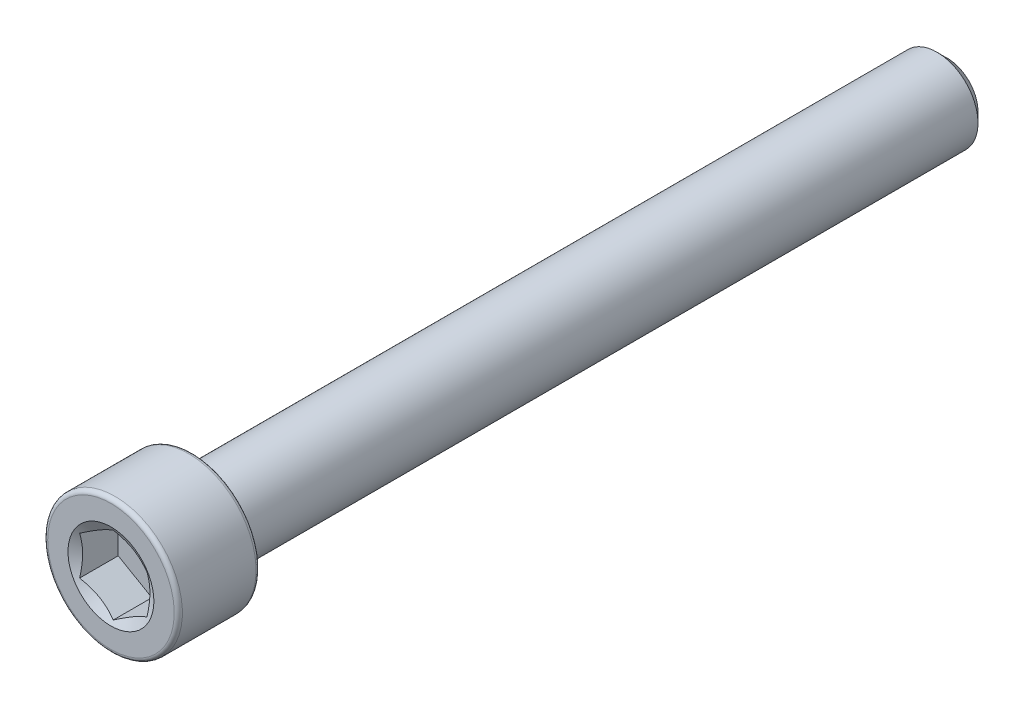
ISO-10303-21;
HEADER;
FILE_DESCRIPTION(('STEP AP214'),'2;1');
FILE_NAME('part.step','',(''),(''),'','','');
FILE_SCHEMA(('AUTOMOTIVE_DESIGN { 1 0 10303 214 1 1 1 1 }'));
ENDSEC;
DATA;
#1=APPLICATION_CONTEXT('core data for automotive mechanical design processes');
#2=APPLICATION_PROTOCOL_DEFINITION('international standard','automotive_design',2000,#1);
#3=PRODUCT_CONTEXT('',#1,'mechanical');
#4=PRODUCT('Part','Part','',(#3));
#5=PRODUCT_RELATED_PRODUCT_CATEGORY('part','',(#4));
#6=PRODUCT_DEFINITION_FORMATION('','',#4);
#7=PRODUCT_DEFINITION_CONTEXT('part definition',#1,'design');
#8=PRODUCT_DEFINITION('design','',#6,#7);
#9=PRODUCT_DEFINITION_SHAPE('','',#8);
#10=(LENGTH_UNIT() NAMED_UNIT(*) SI_UNIT(.MILLI.,.METRE.));
#11=(NAMED_UNIT(*) PLANE_ANGLE_UNIT() SI_UNIT($,.RADIAN.));
#12=(NAMED_UNIT(*) SI_UNIT($,.STERADIAN.) SOLID_ANGLE_UNIT());
#13=UNCERTAINTY_MEASURE_WITH_UNIT(LENGTH_MEASURE(1.E-05),#10,'distance_accuracy_value','');
#14=(GEOMETRIC_REPRESENTATION_CONTEXT(3) GLOBAL_UNCERTAINTY_ASSIGNED_CONTEXT((#13)) GLOBAL_UNIT_ASSIGNED_CONTEXT((#10,
#11,#12)) REPRESENTATION_CONTEXT('',''));
#15=CARTESIAN_POINT('',(0.,0.,0.));
#16=DIRECTION('',(0.,0.,1.));
#17=DIRECTION('',(1.,0.,0.));
#18=AXIS2_PLACEMENT_3D('',#15,#16,#17);
#19=CARTESIAN_POINT('',(0.,0.,-24.638));
#20=DIRECTION('',(0.,0.,-1.));
#21=DIRECTION('',(-1.,0.,0.));
#22=AXIS2_PLACEMENT_3D('',#19,#20,#21);
#23=PLANE('',#22);
#24=CARTESIAN_POINT('',(0.,0.,-24.638));
#25=DIRECTION('',(0.,0.,-1.));
#26=DIRECTION('',(-1.,0.,0.));
#27=AXIS2_PLACEMENT_3D('',#24,#25,#26);
#28=CIRCLE('',#27,1.81768750000002);
#29=CARTESIAN_POINT('',(-1.81768750000002,0.,-24.638));
#30=VERTEX_POINT('',#29);
#31=EDGE_CURVE('E50',#30,#30,#28,.T.);
#32=ORIENTED_EDGE('',*,*,#31,.T.);
#33=EDGE_LOOP('',(#32));
#34=FACE_BOUND('',#33,.T.);
#35=ADVANCED_FACE('F37',(#34),#23,.T.);
#36=CARTESIAN_POINT('',(0.,0.,-24.638));
#37=DIRECTION('',(0.,0.,1.));
#38=DIRECTION('',(1.,0.,0.));
#39=AXIS2_PLACEMENT_3D('',#36,#37,#38);
#40=CONICAL_SURFACE('',#39,1.81768750000002,0.78539816339745);
#41=CARTESIAN_POINT('',(0.,0.,-24.0426875));
#42=DIRECTION('',(0.,0.,-1.));
#43=DIRECTION('',(-1.,0.,0.));
#44=AXIS2_PLACEMENT_3D('',#41,#42,#43);
#45=CIRCLE('',#44,2.41300000000002);
#46=CARTESIAN_POINT('',(-2.41300000000002,0.,-24.0426875));
#47=VERTEX_POINT('',#46);
#48=EDGE_CURVE('E135',#47,#47,#45,.T.);
#49=ORIENTED_EDGE('',*,*,#48,.T.);
#50=EDGE_LOOP('',(#49));
#51=FACE_BOUND('',#50,.T.);
#52=ORIENTED_EDGE('',*,*,#31,.F.);
#53=EDGE_LOOP('',(#52));
#54=FACE_BOUND('',#53,.T.);
#55=ADVANCED_FACE('F141',(#51,#54),#40,.T.);
#56=CARTESIAN_POINT('',(0.,0.,-24.638));
#57=DIRECTION('',(0.,0.,-1.));
#58=DIRECTION('',(-1.,0.,0.));
#59=AXIS2_PLACEMENT_3D('',#56,#57,#58);
#60=CYLINDRICAL_SURFACE('',#59,2.41300000000002);
#61=CARTESIAN_POINT('',(0.,0.,19.812));
#62=DIRECTION('',(0.,0.,-1.));
#63=DIRECTION('',(-1.,0.,0.));
#64=AXIS2_PLACEMENT_3D('',#61,#62,#63);
#65=CIRCLE('',#64,2.41300000000002);
#66=CARTESIAN_POINT('',(-2.41300000000002,0.,19.812));
#67=VERTEX_POINT('',#66);
#68=EDGE_CURVE('E132',#67,#67,#65,.T.);
#69=ORIENTED_EDGE('',*,*,#68,.T.);
#70=EDGE_LOOP('',(#69));
#71=FACE_BOUND('',#70,.T.);
#72=ORIENTED_EDGE('',*,*,#48,.F.);
#73=EDGE_LOOP('',(#72));
#74=FACE_BOUND('',#73,.T.);
#75=ADVANCED_FACE('F143',(#71,#74),#60,.T.);
#76=CARTESIAN_POINT('',(0.,2.413,19.812));
#77=DIRECTION('',(0.,0.,-1.));
#78=DIRECTION('',(-1.,0.,0.));
#79=AXIS2_PLACEMENT_3D('',#76,#77,#78);
#80=PLANE('',#79);
#81=CARTESIAN_POINT('',(0.,0.,19.812));
#82=DIRECTION('',(0.,0.,-1.));
#83=DIRECTION('',(-1.,0.,0.));
#84=AXIS2_PLACEMENT_3D('',#81,#82,#83);
#85=CIRCLE('',#84,3.72745);
#86=CARTESIAN_POINT('',(-3.72745,0.,19.812));
#87=VERTEX_POINT('',#86);
#88=EDGE_CURVE('E129',#87,#87,#85,.T.);
#89=ORIENTED_EDGE('',*,*,#88,.T.);
#90=EDGE_LOOP('',(#89));
#91=FACE_BOUND('',#90,.T.);
#92=ORIENTED_EDGE('',*,*,#68,.F.);
#93=EDGE_LOOP('',(#92));
#94=FACE_BOUND('',#93,.T.);
#95=ADVANCED_FACE('F149',(#91,#94),#80,.T.);
#96=CARTESIAN_POINT('',(0.,0.,20.0533));
#97=DIRECTION('',(0.,0.,-1.));
#98=DIRECTION('',(-1.,0.,0.));
#99=AXIS2_PLACEMENT_3D('',#96,#97,#98);
#100=TOROIDAL_SURFACE('',#99,3.72745,0.2413);
#101=CARTESIAN_POINT('',(0.,0.,20.0533));
#102=DIRECTION('',(0.,0.,-1.));
#103=DIRECTION('',(-1.,0.,0.));
#104=AXIS2_PLACEMENT_3D('',#101,#102,#103);
#105=CIRCLE('',#104,3.96875);
#106=CARTESIAN_POINT('',(-3.96875,0.,20.0533));
#107=VERTEX_POINT('',#106);
#108=EDGE_CURVE('E126',#107,#107,#105,.T.);
#109=ORIENTED_EDGE('',*,*,#108,.T.);
#110=EDGE_LOOP('',(#109));
#111=FACE_BOUND('',#110,.T.);
#112=ORIENTED_EDGE('',*,*,#88,.F.);
#113=EDGE_LOOP('',(#112));
#114=FACE_BOUND('',#113,.T.);
#115=ADVANCED_FACE('F155',(#111,#114),#100,.T.);
#116=CARTESIAN_POINT('',(0.,0.,-24.638));
#117=DIRECTION('',(0.,0.,-1.));
#118=DIRECTION('',(-1.,0.,0.));
#119=AXIS2_PLACEMENT_3D('',#116,#117,#118);
#120=CYLINDRICAL_SURFACE('',#119,3.96875);
#121=CARTESIAN_POINT('',(0.,0.,24.3967));
#122=DIRECTION('',(0.,0.,-1.));
#123=DIRECTION('',(-1.,0.,0.));
#124=AXIS2_PLACEMENT_3D('',#121,#122,#123);
#125=CIRCLE('',#124,3.96875);
#126=CARTESIAN_POINT('',(-3.96875,0.,24.3967));
#127=VERTEX_POINT('',#126);
#128=EDGE_CURVE('E123',#127,#127,#125,.T.);
#129=ORIENTED_EDGE('',*,*,#128,.T.);
#130=EDGE_LOOP('',(#129));
#131=FACE_BOUND('',#130,.T.);
#132=ORIENTED_EDGE('',*,*,#108,.F.);
#133=EDGE_LOOP('',(#132));
#134=FACE_BOUND('',#133,.T.);
#135=ADVANCED_FACE('F159',(#131,#134),#120,.T.);
#136=CARTESIAN_POINT('',(0.,0.,24.3967));
#137=DIRECTION('',(0.,0.,-1.));
#138=DIRECTION('',(-1.,0.,0.));
#139=AXIS2_PLACEMENT_3D('',#136,#137,#138);
#140=TOROIDAL_SURFACE('',#139,3.72745,0.241299999999999);
#141=CARTESIAN_POINT('',(0.,0.,24.638));
#142=DIRECTION('',(0.,0.,-1.));
#143=DIRECTION('',(-1.,0.,0.));
#144=AXIS2_PLACEMENT_3D('',#141,#142,#143);
#145=CIRCLE('',#144,3.72745);
#146=CARTESIAN_POINT('',(-3.72745,0.,24.638));
#147=VERTEX_POINT('',#146);
#148=EDGE_CURVE('E120',#147,#147,#145,.T.);
#149=ORIENTED_EDGE('',*,*,#148,.T.);
#150=EDGE_LOOP('',(#149));
#151=FACE_BOUND('',#150,.T.);
#152=ORIENTED_EDGE('',*,*,#128,.F.);
#153=EDGE_LOOP('',(#152));
#154=FACE_BOUND('',#153,.T.);
#155=ADVANCED_FACE('F163',(#151,#154),#140,.T.);
#156=CARTESIAN_POINT('',(0.,3.72744999999999,24.638));
#157=DIRECTION('',(0.,0.,1.));
#158=DIRECTION('',(1.,0.,0.));
#159=AXIS2_PLACEMENT_3D('',#156,#157,#158);
#160=PLANE('',#159);
#161=CARTESIAN_POINT('',(0.,0.,24.638));
#162=DIRECTION('',(0.,0.,1.));
#163=DIRECTION('',(1.,0.,0.));
#164=AXIS2_PLACEMENT_3D('',#161,#162,#163);
#165=CIRCLE('',#164,2.53070740070526);
#166=CARTESIAN_POINT('',(2.53070740070526,0.,24.638));
#167=VERTEX_POINT('',#166);
#168=EDGE_CURVE('E257',#167,#167,#165,.T.);
#169=ORIENTED_EDGE('',*,*,#168,.F.);
#170=EDGE_LOOP('',(#169));
#171=FACE_BOUND('',#170,.T.);
#172=ORIENTED_EDGE('',*,*,#148,.F.);
#173=EDGE_LOOP('',(#172));
#174=FACE_BOUND('',#173,.T.);
#175=ADVANCED_FACE('F167',(#171,#174),#160,.T.);
#176=CARTESIAN_POINT('',(0.,0.,24.638));
#177=DIRECTION('',(0.,0.,1.));
#178=DIRECTION('',(1.,0.,0.));
#179=AXIS2_PLACEMENT_3D('',#176,#177,#178);
#180=CONICAL_SURFACE('',#179,2.53070740070526,1.0471975511966);
#181=ORIENTED_EDGE('',*,*,#168,.T.);
#182=EDGE_LOOP('',(#181));
#183=FACE_BOUND('',#182,.T.);
#184=CARTESIAN_POINT('',(1.98457499999999,1.14556397036932,24.4998787393351));
#185=CARTESIAN_POINT('',(1.89737036121931,1.19591159204393,24.4707977498695));
#186=CARTESIAN_POINT('',(1.80941298069499,1.24669380936686,24.4443492756563));
#187=CARTESIAN_POINT('',(1.63197502132767,1.34913766297204,24.3981823388358));
#188=CARTESIAN_POINT('',(1.54249128874367,1.4008011200675,24.3784802098783));
#189=CARTESIAN_POINT('',(1.36463285198752,1.50348773640631,24.3478097995608));
#190=CARTESIAN_POINT('',(1.2762855196939,1.55449509248822,24.3366374103495));
#191=CARTESIAN_POINT('',(1.09917497188905,1.65674991493967,24.3232978636837));
#192=CARTESIAN_POINT('',(1.01041240048945,1.70799700943119,24.3211196620894));
#193=CARTESIAN_POINT('',(0.844542697135334,1.8037619273131,24.3256416191376));
#194=CARTESIAN_POINT('',(0.76741078433409,1.84829405793201,24.3312314810852));
#195=CARTESIAN_POINT('',(0.613649492810916,1.93706818098385,24.3489510015263));
#196=CARTESIAN_POINT('',(0.537020646254473,1.98130986617091,24.3610867179588));
#197=CARTESIAN_POINT('',(0.382942111493214,2.07026714969166,24.3914262264737));
#198=CARTESIAN_POINT('',(0.305511932787315,2.11497148421091,24.4097586769203));
#199=CARTESIAN_POINT('',(0.15180668875641,2.20371324822802,24.4513665740295));
#200=CARTESIAN_POINT('',(0.0755296529470656,2.24775181538553,24.4746322389117));
#201=CARTESIAN_POINT('',(-0.000200000000001569,2.29147435090015,24.4998787393351));
#202=B_SPLINE_CURVE_WITH_KNOTS('',3,(#184,#185,#186,#187,#188,#189,#190,#191,#192,#193,#194,
#195,#196,#197,#198,#199,#200,#201),.UNSPECIFIED.,.F.,.F.,(4,2,2,2,2,2,2,2,4),(0.,
0.314555137114084,0.629866549668802,0.937373439505927,1.24450262309397,1.51196650590477,
1.77967834211414,2.05332989762154,2.32644383656792),.UNSPECIFIED.);
#203=CARTESIAN_POINT('',(1.98437499999999,1.14567944042316,24.4998120676293));
#204=VERTEX_POINT('',#203);
#205=CARTESIAN_POINT('',(0.,2.29135888084631,24.4998120676293));
#206=VERTEX_POINT('',#205);
#207=EDGE_CURVE('E104',#204,#206,#202,.T.);
#208=ORIENTED_EDGE('',*,*,#207,.F.);
#209=CARTESIAN_POINT('',(1.98437499999999,-3.0002672974234,25.2536996764954));
#210=CARTESIAN_POINT('',(1.98437499999999,-2.91417852714618,25.2122554995199));
#211=CARTESIAN_POINT('',(1.98437499999999,-2.82788354366183,25.1712318701391));
#212=CARTESIAN_POINT('',(1.98437499999999,-2.65477109089713,25.0902640719882));
#213=CARTESIAN_POINT('',(1.98437499999999,-2.56795353399494,25.0503200907809));
#214=CARTESIAN_POINT('',(1.98437499999999,-2.39320060303682,24.9715322756389));
#215=CARTESIAN_POINT('',(1.98437499999999,-2.30526165499614,24.9326963397322));
#216=CARTESIAN_POINT('',(1.98437499999999,-2.12865626167958,24.8567217534969));
#217=CARTESIAN_POINT('',(1.98437499999999,-2.0399898536152,24.8195830169827));
#218=CARTESIAN_POINT('',(1.98437499999999,-1.85931319770472,24.7464519444036));
#219=CARTESIAN_POINT('',(1.98437499999999,-1.76727839255488,24.7105199296325));
#220=CARTESIAN_POINT('',(1.98437499999999,-1.58210416266519,24.6415670586381));
#221=CARTESIAN_POINT('',(1.98437499999999,-1.48896461158262,24.6085465390977));
#222=CARTESIAN_POINT('',(1.98437499999999,-1.30163731722862,24.5463414082388));
#223=CARTESIAN_POINT('',(1.98437499999999,-1.20745247053434,24.517148166413));
#224=CARTESIAN_POINT('',(1.98437499999999,-1.01772735134059,24.4635801299636));
#225=CARTESIAN_POINT('',(1.98437499999999,-0.922187418803861,24.4392041489301));
#226=CARTESIAN_POINT('',(1.98437499999999,-0.730187774437193,24.3966100252547));
#227=CARTESIAN_POINT('',(1.98437499999999,-0.633734462555377,24.3783635885809));
#228=CARTESIAN_POINT('',(1.98437499999999,-0.439715276353549,24.3491213033277));
#229=CARTESIAN_POINT('',(1.98437499999999,-0.342149489314398,24.338124889865));
#230=CARTESIAN_POINT('',(1.98437499999999,-0.147628044199055,24.3244070417718));
#231=CARTESIAN_POINT('',(1.98437499999999,-0.0506796597421224,24.3215854104354));
#232=CARTESIAN_POINT('',(1.98437499999999,0.143103115571662,24.324185514727));
#233=CARTESIAN_POINT('',(1.98437499999999,0.239937499827363,24.3296077062766));
#234=CARTESIAN_POINT('',(1.98437499999999,0.476970423936255,24.3524923549886));
#235=CARTESIAN_POINT('',(1.98437499999999,0.616748292390844,24.3743270404436));
#236=CARTESIAN_POINT('',(1.98437499999999,0.893607928884515,24.4311402077941));
#237=CARTESIAN_POINT('',(1.98437499999999,1.030686768829,24.4661322170173));
#238=CARTESIAN_POINT('',(1.98437499999999,1.30511969999723,24.5464152230234));
#239=CARTESIAN_POINT('',(1.98437499999999,1.44240893450286,24.5919226619543));
#240=CARTESIAN_POINT('',(1.98437499999999,1.64644508842433,24.6652634246735));
#241=CARTESIAN_POINT('',(1.98437499999999,1.71413212999321,24.6905533074583));
#242=CARTESIAN_POINT('',(1.98437499999999,1.84895802350132,24.7425549515399));
#243=CARTESIAN_POINT('',(1.98437499999999,1.91609688529705,24.7692666872058));
#244=CARTESIAN_POINT('',(1.98437499999999,2.09043183263474,24.8404120267758));
#245=CARTESIAN_POINT('',(1.98437499999999,2.19724734382523,24.8857757687467));
#246=CARTESIAN_POINT('',(1.98437499999999,2.4098815319363,24.9787895460846));
#247=CARTESIAN_POINT('',(1.98437499999999,2.51570012860561,25.0264397636623));
#248=CARTESIAN_POINT('',(1.98437499999999,2.72655852247189,25.1235005052355));
#249=CARTESIAN_POINT('',(1.98437499999999,2.83159810540153,25.1729114933103));
#250=CARTESIAN_POINT('',(1.98437499999999,3.04102680140026,25.2730954913632));
#251=CARTESIAN_POINT('',(1.98437499999999,3.14541589892037,25.3238685337466));
#252=CARTESIAN_POINT('',(1.98437499999999,3.45805934392728,25.4779112385608));
#253=CARTESIAN_POINT('',(1.98437499999999,3.66552471194404,25.5827805102459));
#254=CARTESIAN_POINT('',(1.98437499999999,4.07900502507438,25.7952421528608));
#255=CARTESIAN_POINT('',(1.98437499999999,4.28502019488324,25.9028340895145));
#256=CARTESIAN_POINT('',(1.98437499999999,4.67597606585553,26.1092945522279));
#257=CARTESIAN_POINT('',(1.98437499999999,4.8610092056076,26.2079883192138));
#258=CARTESIAN_POINT('',(1.98437499999999,5.23047989061984,26.406503421698));
#259=CARTESIAN_POINT('',(1.98437499999999,5.41491740749766,26.5063248099387));
#260=CARTESIAN_POINT('',(1.98437499999999,5.78283314119707,26.7065376967861));
#261=CARTESIAN_POINT('',(1.98437499999999,5.9663126029318,26.8069269102676));
#262=CARTESIAN_POINT('',(1.98437499999999,6.33289930192254,27.0083559236772));
#263=CARTESIAN_POINT('',(1.98437499999999,6.51600656168199,27.1093956826348));
#264=CARTESIAN_POINT('',(1.98437499999999,6.69898126466818,27.2106733706002));
#265=B_SPLINE_CURVE_WITH_KNOTS('',3,(#209,#210,#211,#212,#213,#214,#215,#216,#217,#218,#219,
#220,#221,#222,#223,#224,#225,#226,#227,#228,#229,#230,#231,#232,#233,#234,#235,#236,#237,#238,
#239,#240,#241,#242,#243,#244,#245,#246,#247,#248,#249,#250,#251,#252,#253,#254,#255,#256,#257,
#258,#259,#260,#261,#262,#263,#264),.UNSPECIFIED.,.F.,.F.,(4,2,2,2,2,2,2,2,2,2,2,2,2,2,2,2,2,2,
2,2,2,2,2,2,2,2,2,4),(0.,0.286639682230867,0.573328845206278,0.861712521680999,1.15008153741611,
1.44644465754249,1.74284200403623,2.03855903673008,2.3342031483046,2.62846318470745,
2.92270029122632,3.21331540991078,3.50394660154196,3.9274884183087,4.35146688350434,
4.78510306957839,5.001864482484,5.21862198930868,5.56673163285504,5.91486906368417,
6.26309894038446,6.61133710935789,7.30869129939499,8.00593495112091,8.63505562775267,
9.26420585322012,9.89164710445792,10.5190492194134),.UNSPECIFIED.);
#266=CARTESIAN_POINT('',(1.98437499999999,-1.14567944042316,24.4998120676293));
#267=VERTEX_POINT('',#266);
#268=EDGE_CURVE('E213',#267,#204,#265,.T.);
#269=ORIENTED_EDGE('',*,*,#268,.F.);
#270=CARTESIAN_POINT('',(-0.000200000000000694,-2.29147435090015,24.4998787393351));
#271=CARTESIAN_POINT('',(0.0870046387806752,-2.24112672922555,24.4707977498695));
#272=CARTESIAN_POINT('',(0.174962019304995,-2.19034451190262,24.4443492756563));
#273=CARTESIAN_POINT('',(0.352399978672317,-2.08790065829743,24.3981823388358));
#274=CARTESIAN_POINT('',(0.441883711256315,-2.03623720120197,24.3784802098783));
#275=CARTESIAN_POINT('',(0.619742148012464,-1.93355058486316,24.3478097995608));
#276=CARTESIAN_POINT('',(0.708089480306088,-1.88254322878125,24.3366374103495));
#277=CARTESIAN_POINT('',(0.885200028110943,-1.7802884063298,24.3232978636837));
#278=CARTESIAN_POINT('',(0.97396259951054,-1.72904131183828,24.3211196620894));
#279=CARTESIAN_POINT('',(1.13983230286465,-1.63327639395638,24.3256416191376));
#280=CARTESIAN_POINT('',(1.2169642156659,-1.58874426333747,24.3312314810852));
#281=CARTESIAN_POINT('',(1.37072550718907,-1.49997014028562,24.3489510015263));
#282=CARTESIAN_POINT('',(1.44735435374551,-1.45572845509856,24.3610867179588));
#283=CARTESIAN_POINT('',(1.60143288850677,-1.36677117157781,24.3914262264737));
#284=CARTESIAN_POINT('',(1.67886306721267,-1.32206683705856,24.4097586769203));
#285=CARTESIAN_POINT('',(1.83256831124358,-1.23332507304146,24.4513665740295));
#286=CARTESIAN_POINT('',(1.90884534705292,-1.18928650588395,24.4746322389117));
#287=CARTESIAN_POINT('',(1.98457499999999,-1.14556397036932,24.4998787393351));
#288=B_SPLINE_CURVE_WITH_KNOTS('',3,(#270,#271,#272,#273,#274,#275,#276,#277,#278,#279,#280,
#281,#282,#283,#284,#285,#286,#287),.UNSPECIFIED.,.F.,.F.,(4,2,2,2,2,2,2,2,4),(0.,
0.314555137114084,0.629866549668802,0.937373439505926,1.24450262309397,1.51196650590477,
1.77967834211414,2.05332989762154,2.32644383656792),.UNSPECIFIED.);
#289=CARTESIAN_POINT('',(0.,-2.29135888084632,24.4998120676293));
#290=VERTEX_POINT('',#289);
#291=EDGE_CURVE('E207',#290,#267,#288,.T.);
#292=ORIENTED_EDGE('',*,*,#291,.F.);
#293=CARTESIAN_POINT('',(-1.98457499999999,-1.14556397036932,24.4998787393351));
#294=CARTESIAN_POINT('',(-1.89737036121931,-1.19591159204393,24.4707977498695));
#295=CARTESIAN_POINT('',(-1.80941298069499,-1.24669380936686,24.4443492756563));
#296=CARTESIAN_POINT('',(-1.63197502132767,-1.34913766297204,24.3981823388358));
#297=CARTESIAN_POINT('',(-1.54249128874367,-1.4008011200675,24.3784802098783));
#298=CARTESIAN_POINT('',(-1.36463285198752,-1.50348773640631,24.3478097995608));
#299=CARTESIAN_POINT('',(-1.2762855196939,-1.55449509248822,24.3366374103495));
#300=CARTESIAN_POINT('',(-1.09917497188904,-1.65674991493968,24.3232978636837));
#301=CARTESIAN_POINT('',(-1.01041240048945,-1.7079970094312,24.3211196620894));
#302=CARTESIAN_POINT('',(-0.844542697135333,-1.8037619273131,24.3256416191376));
#303=CARTESIAN_POINT('',(-0.767410784334089,-1.84829405793201,24.3312314810852));
#304=CARTESIAN_POINT('',(-0.613649492810916,-1.93706818098386,24.3489510015263));
#305=CARTESIAN_POINT('',(-0.537020646254473,-1.98130986617091,24.3610867179588));
#306=CARTESIAN_POINT('',(-0.382942111493215,-2.07026714969166,24.3914262264737));
#307=CARTESIAN_POINT('',(-0.305511932787316,-2.11497148421092,24.4097586769203));
#308=CARTESIAN_POINT('',(-0.151806688756412,-2.20371324822802,24.4513665740295));
#309=CARTESIAN_POINT('',(-0.0755296529470681,-2.24775181538553,24.4746322389117));
#310=CARTESIAN_POINT('',(0.000199999999998951,-2.29147435090015,24.4998787393351));
#311=B_SPLINE_CURVE_WITH_KNOTS('',3,(#293,#294,#295,#296,#297,#298,#299,#300,#301,#302,#303,
#304,#305,#306,#307,#308,#309,#310),.UNSPECIFIED.,.F.,.F.,(4,2,2,2,2,2,2,2,4),(0.,
0.314555137114082,0.629866549668802,0.937373439505927,1.24450262309397,1.51196650590477,
1.77967834211414,2.05332989762153,2.32644383656792),.UNSPECIFIED.);
#312=CARTESIAN_POINT('',(-1.98437499999999,-1.14567944042316,24.4998120676293));
#313=VERTEX_POINT('',#312);
#314=EDGE_CURVE('E57',#313,#290,#311,.T.);
#315=ORIENTED_EDGE('',*,*,#314,.F.);
#316=CARTESIAN_POINT('',(-1.98437499999999,-3.0002672974234,25.2536996764954));
#317=CARTESIAN_POINT('',(-1.98437499999999,-2.91417852714618,25.2122554995199));
#318=CARTESIAN_POINT('',(-1.98437499999999,-2.82788354366183,25.1712318701391));
#319=CARTESIAN_POINT('',(-1.98437499999999,-2.65477109089713,25.0902640719882));
#320=CARTESIAN_POINT('',(-1.98437499999999,-2.56795353399494,25.0503200907809));
#321=CARTESIAN_POINT('',(-1.98437499999999,-2.39320060303682,24.9715322756389));
#322=CARTESIAN_POINT('',(-1.98437499999999,-2.30526165499614,24.9326963397322));
#323=CARTESIAN_POINT('',(-1.98437499999999,-2.12865626167958,24.8567217534969));
#324=CARTESIAN_POINT('',(-1.98437499999999,-2.0399898536152,24.8195830169827));
#325=CARTESIAN_POINT('',(-1.98437499999999,-1.85931319770472,24.7464519444036));
#326=CARTESIAN_POINT('',(-1.98437499999999,-1.76727839255488,24.7105199296325));
#327=CARTESIAN_POINT('',(-1.98437499999999,-1.58210416266519,24.6415670586381));
#328=CARTESIAN_POINT('',(-1.98437499999999,-1.48896461158262,24.6085465390977));
#329=CARTESIAN_POINT('',(-1.98437499999999,-1.30163731722862,24.5463414082388));
#330=CARTESIAN_POINT('',(-1.98437499999999,-1.20745247053434,24.517148166413));
#331=CARTESIAN_POINT('',(-1.98437499999999,-1.0177273513406,24.4635801299636));
#332=CARTESIAN_POINT('',(-1.98437499999999,-0.922187418803862,24.4392041489301));
#333=CARTESIAN_POINT('',(-1.98437499999999,-0.730187774437194,24.3966100252547));
#334=CARTESIAN_POINT('',(-1.98437499999999,-0.633734462555377,24.3783635885809));
#335=CARTESIAN_POINT('',(-1.98437499999999,-0.439715276353549,24.3491213033277));
#336=CARTESIAN_POINT('',(-1.98437499999999,-0.342149489314398,24.338124889865));
#337=CARTESIAN_POINT('',(-1.98437499999999,-0.147628044199055,24.3244070417718));
#338=CARTESIAN_POINT('',(-1.98437499999999,-0.0506796597421226,24.3215854104354));
#339=CARTESIAN_POINT('',(-1.98437499999999,0.143103115571662,24.324185514727));
#340=CARTESIAN_POINT('',(-1.98437499999999,0.239937499827362,24.3296077062766));
#341=CARTESIAN_POINT('',(-1.98437499999999,0.476970423936254,24.3524923549886));
#342=CARTESIAN_POINT('',(-1.98437499999999,0.616748292390843,24.3743270404436));
#343=CARTESIAN_POINT('',(-1.98437499999999,0.893607928884513,24.4311402077941));
#344=CARTESIAN_POINT('',(-1.98437499999999,1.030686768829,24.4661322170173));
#345=CARTESIAN_POINT('',(-1.98437499999999,1.30511969999723,24.5464152230234));
#346=CARTESIAN_POINT('',(-1.98437499999999,1.44240893450287,24.5919226619543));
#347=CARTESIAN_POINT('',(-1.98437499999999,1.64644508842433,24.6652634246735));
#348=CARTESIAN_POINT('',(-1.98437499999999,1.71413212999321,24.6905533074583));
#349=CARTESIAN_POINT('',(-1.98437499999999,1.84895802350132,24.7425549515399));
#350=CARTESIAN_POINT('',(-1.98437499999999,1.91609688529705,24.7692666872058));
#351=CARTESIAN_POINT('',(-1.98437499999999,2.09043183263474,24.8404120267758));
#352=CARTESIAN_POINT('',(-1.98437499999999,2.19724734382523,24.8857757687467));
#353=CARTESIAN_POINT('',(-1.98437499999999,2.4098815319363,24.9787895460846));
#354=CARTESIAN_POINT('',(-1.98437499999999,2.51570012860561,25.0264397636623));
#355=CARTESIAN_POINT('',(-1.98437499999999,2.72655852247189,25.1235005052355));
#356=CARTESIAN_POINT('',(-1.98437499999999,2.83159810540153,25.1729114933103));
#357=CARTESIAN_POINT('',(-1.98437499999999,3.04102680140026,25.2730954913632));
#358=CARTESIAN_POINT('',(-1.98437499999999,3.14541589892037,25.3238685337466));
#359=CARTESIAN_POINT('',(-1.98437499999999,3.45805934392728,25.4779112385608));
#360=CARTESIAN_POINT('',(-1.98437499999999,3.66552471194404,25.5827805102459));
#361=CARTESIAN_POINT('',(-1.98437499999999,4.07900502507438,25.7952421528608));
#362=CARTESIAN_POINT('',(-1.98437499999999,4.28502019488324,25.9028340895145));
#363=CARTESIAN_POINT('',(-1.98437499999999,4.67597606585553,26.1092945522279));
#364=CARTESIAN_POINT('',(-1.98437499999999,4.8610092056076,26.2079883192138));
#365=CARTESIAN_POINT('',(-1.98437499999999,5.23047989061984,26.406503421698));
#366=CARTESIAN_POINT('',(-1.98437499999999,5.41491740749766,26.5063248099387));
#367=CARTESIAN_POINT('',(-1.98437499999999,5.78283314119707,26.7065376967861));
#368=CARTESIAN_POINT('',(-1.98437499999999,5.9663126029318,26.8069269102676));
#369=CARTESIAN_POINT('',(-1.98437499999999,6.33289930192254,27.0083559236772));
#370=CARTESIAN_POINT('',(-1.98437499999999,6.51600656168199,27.1093956826348));
#371=CARTESIAN_POINT('',(-1.98437499999999,6.69898126466819,27.2106733706002));
#372=B_SPLINE_CURVE_WITH_KNOTS('',3,(#316,#317,#318,#319,#320,#321,#322,#323,#324,#325,#326,
#327,#328,#329,#330,#331,#332,#333,#334,#335,#336,#337,#338,#339,#340,#341,#342,#343,#344,#345,
#346,#347,#348,#349,#350,#351,#352,#353,#354,#355,#356,#357,#358,#359,#360,#361,#362,#363,#364,
#365,#366,#367,#368,#369,#370,#371),.UNSPECIFIED.,.F.,.F.,(4,2,2,2,2,2,2,2,2,2,2,2,2,2,2,2,2,2,
2,2,2,2,2,2,2,2,2,4),(0.,0.286639682230867,0.573328845206279,0.861712521681,1.15008153741611,
1.4464446575425,1.74284200403624,2.03855903673008,2.3342031483046,2.62846318470745,
2.92270029122632,3.21331540991078,3.50394660154196,3.9274884183087,4.35146688350434,
4.78510306957839,5.001864482484,5.21862198930868,5.56673163285504,5.91486906368417,
6.26309894038446,6.61133710935789,7.30869129939499,8.00593495112091,8.63505562775267,
9.26420585322012,9.89164710445792,10.5190492194134),.UNSPECIFIED.);
#373=CARTESIAN_POINT('',(-1.98437499999999,1.14567944042316,24.4998120676293));
#374=VERTEX_POINT('',#373);
#375=EDGE_CURVE('E11',#374,#313,#372,.F.);
#376=ORIENTED_EDGE('',*,*,#375,.F.);
#377=CARTESIAN_POINT('',(0.000199999999997662,2.29147435090015,24.4998787393351));
#378=CARTESIAN_POINT('',(-0.087004638780678,2.24112672922554,24.4707977498695));
#379=CARTESIAN_POINT('',(-0.174962019304997,2.19034451190262,24.4443492756563));
#380=CARTESIAN_POINT('',(-0.352399978672319,2.08790065829743,24.3981823388358));
#381=CARTESIAN_POINT('',(-0.441883711256318,2.03623720120197,24.3784802098783));
#382=CARTESIAN_POINT('',(-0.619742148012467,1.93355058486316,24.3478097995608));
#383=CARTESIAN_POINT('',(-0.708089480306091,1.88254322878125,24.3366374103495));
#384=CARTESIAN_POINT('',(-0.885200028110946,1.7802884063298,24.3232978636837));
#385=CARTESIAN_POINT('',(-0.973962599510543,1.72904131183828,24.3211196620894));
#386=CARTESIAN_POINT('',(-1.13983230286466,1.63327639395637,24.3256416191376));
#387=CARTESIAN_POINT('',(-1.2169642156659,1.58874426333747,24.3312314810852));
#388=CARTESIAN_POINT('',(-1.37072550718908,1.49997014028562,24.3489510015263));
#389=CARTESIAN_POINT('',(-1.44735435374552,1.45572845509856,24.3610867179588));
#390=CARTESIAN_POINT('',(-1.60143288850678,1.36677117157781,24.3914262264737));
#391=CARTESIAN_POINT('',(-1.67886306721267,1.32206683705856,24.4097586769203));
#392=CARTESIAN_POINT('',(-1.83256831124358,1.23332507304146,24.4513665740295));
#393=CARTESIAN_POINT('',(-1.90884534705292,1.18928650588395,24.4746322389117));
#394=CARTESIAN_POINT('',(-1.98457499999999,1.14556397036932,24.4998787393351));
#395=B_SPLINE_CURVE_WITH_KNOTS('',3,(#377,#378,#379,#380,#381,#382,#383,#384,#385,#386,#387,
#388,#389,#390,#391,#392,#393,#394),.UNSPECIFIED.,.F.,.F.,(4,2,2,2,2,2,2,2,4),(0.,
0.314555137114083,0.629866549668802,0.937373439505926,1.24450262309397,1.51196650590477,
1.77967834211414,2.05332989762153,2.32644383656792),.UNSPECIFIED.);
#396=EDGE_CURVE('E95',#206,#374,#395,.T.);
#397=ORIENTED_EDGE('',*,*,#396,.F.);
#398=EDGE_LOOP('',(#208,#269,#292,#315,#376,#397));
#399=FACE_BOUND('',#398,.T.);
#400=ADVANCED_FACE('F94',(#183,#399),#180,.F.);
#401=CARTESIAN_POINT('',(0.,0.,22.225));
#402=DIRECTION('',(0.,0.,1.));
#403=DIRECTION('',(1.,0.,0.));
#404=AXIS2_PLACEMENT_3D('',#401,#402,#403);
#405=PLANE('',#404);
#406=DIRECTION('',(-0.866025403784439,-0.5,0.));
#407=VECTOR('',#406,1.);
#408=CARTESIAN_POINT('',(0.,2.29135888084631,22.225));
#409=LINE('',#408,#407);
#410=CARTESIAN_POINT('',(0.,2.29135888084631,22.225));
#411=VERTEX_POINT('',#410);
#412=CARTESIAN_POINT('',(-1.98437499999999,1.14567944042316,22.225));
#413=VERTEX_POINT('',#412);
#414=EDGE_CURVE('E103',#411,#413,#409,.T.);
#415=ORIENTED_EDGE('',*,*,#414,.T.);
#416=DIRECTION('',(0.,-1.,0.));
#417=VECTOR('',#416,1.);
#418=CARTESIAN_POINT('',(-1.98437499999999,1.14567944042316,22.225));
#419=LINE('',#418,#417);
#420=CARTESIAN_POINT('',(-1.98437499999999,-1.14567944042316,22.225));
#421=VERTEX_POINT('',#420);
#422=EDGE_CURVE('E108',#413,#421,#419,.T.);
#423=ORIENTED_EDGE('',*,*,#422,.T.);
#424=DIRECTION('',(0.866025403784439,-0.5,0.));
#425=VECTOR('',#424,1.);
#426=CARTESIAN_POINT('',(-1.98437499999999,-1.14567944042316,22.225));
#427=LINE('',#426,#425);
#428=CARTESIAN_POINT('',(0.,-2.29135888084632,22.225));
#429=VERTEX_POINT('',#428);
#430=EDGE_CURVE('E239',#421,#429,#427,.T.);
#431=ORIENTED_EDGE('',*,*,#430,.T.);
#432=DIRECTION('',(0.866025403784439,0.5,0.));
#433=VECTOR('',#432,1.);
#434=CARTESIAN_POINT('',(0.,-2.29135888084632,22.225));
#435=LINE('',#434,#433);
#436=CARTESIAN_POINT('',(1.98437499999999,-1.14567944042316,22.225));
#437=VERTEX_POINT('',#436);
#438=EDGE_CURVE('E243',#429,#437,#435,.T.);
#439=ORIENTED_EDGE('',*,*,#438,.T.);
#440=DIRECTION('',(0.,1.,0.));
#441=VECTOR('',#440,1.);
#442=CARTESIAN_POINT('',(1.98437499999999,-1.14567944042316,22.225));
#443=LINE('',#442,#441);
#444=CARTESIAN_POINT('',(1.98437499999999,1.14567944042316,22.225));
#445=VERTEX_POINT('',#444);
#446=EDGE_CURVE('E116',#437,#445,#443,.T.);
#447=ORIENTED_EDGE('',*,*,#446,.T.);
#448=DIRECTION('',(-0.866025403784439,0.5,0.));
#449=VECTOR('',#448,1.);
#450=CARTESIAN_POINT('',(1.98437499999999,1.14567944042316,22.225));
#451=LINE('',#450,#449);
#452=EDGE_CURVE('E111',#445,#411,#451,.T.);
#453=ORIENTED_EDGE('',*,*,#452,.T.);
#454=EDGE_LOOP('',(#415,#423,#431,#439,#447,#453));
#455=FACE_BOUND('',#454,.T.);
#456=ADVANCED_FACE('F193',(#455),#405,.T.);
#457=CARTESIAN_POINT('',(-1.98437499999999,1.14567944042316,22.225));
#458=DIRECTION('',(-1.,0.,0.));
#459=DIRECTION('',(0.,-1.,0.));
#460=AXIS2_PLACEMENT_3D('',#457,#458,#459);
#461=PLANE('',#460);
#462=DIRECTION('',(0.,0.,1.));
#463=VECTOR('',#462,1.);
#464=CARTESIAN_POINT('',(-1.98437499999999,1.14567944042316,22.225));
#465=LINE('',#464,#463);
#466=EDGE_CURVE('E101',#413,#374,#465,.T.);
#467=ORIENTED_EDGE('',*,*,#466,.T.);
#468=ORIENTED_EDGE('',*,*,#375,.T.);
#469=DIRECTION('',(0.,0.,1.));
#470=VECTOR('',#469,1.);
#471=CARTESIAN_POINT('',(-1.98437499999999,-1.14567944042316,22.225));
#472=LINE('',#471,#470);
#473=EDGE_CURVE('E110',#421,#313,#472,.T.);
#474=ORIENTED_EDGE('',*,*,#473,.F.);
#475=ORIENTED_EDGE('',*,*,#422,.F.);
#476=EDGE_LOOP('',(#467,#468,#474,#475));
#477=FACE_BOUND('',#476,.T.);
#478=ADVANCED_FACE('F106',(#477),#461,.F.);
#479=CARTESIAN_POINT('',(-1.98437499999999,-1.14567944042316,22.225));
#480=DIRECTION('',(-0.5,-0.866025403784439,0.));
#481=DIRECTION('',(0.866025403784439,-0.5,0.));
#482=AXIS2_PLACEMENT_3D('',#479,#480,#481);
#483=PLANE('',#482);
#484=ORIENTED_EDGE('',*,*,#473,.T.);
#485=ORIENTED_EDGE('',*,*,#314,.T.);
#486=DIRECTION('',(0.,0.,1.));
#487=VECTOR('',#486,1.);
#488=CARTESIAN_POINT('',(0.,-2.29135888084632,22.225));
#489=LINE('',#488,#487);
#490=EDGE_CURVE('E113',#429,#290,#489,.T.);
#491=ORIENTED_EDGE('',*,*,#490,.F.);
#492=ORIENTED_EDGE('',*,*,#430,.F.);
#493=EDGE_LOOP('',(#484,#485,#491,#492));
#494=FACE_BOUND('',#493,.T.);
#495=ADVANCED_FACE('F228',(#494),#483,.F.);
#496=CARTESIAN_POINT('',(0.,-2.29135888084632,22.225));
#497=DIRECTION('',(0.5,-0.866025403784439,0.));
#498=DIRECTION('',(0.866025403784439,0.5,0.));
#499=AXIS2_PLACEMENT_3D('',#496,#497,#498);
#500=PLANE('',#499);
#501=ORIENTED_EDGE('',*,*,#490,.T.);
#502=ORIENTED_EDGE('',*,*,#291,.T.);
#503=DIRECTION('',(0.,0.,1.));
#504=VECTOR('',#503,1.);
#505=CARTESIAN_POINT('',(1.98437499999999,-1.14567944042316,22.225));
#506=LINE('',#505,#504);
#507=EDGE_CURVE('E253',#437,#267,#506,.T.);
#508=ORIENTED_EDGE('',*,*,#507,.F.);
#509=ORIENTED_EDGE('',*,*,#438,.F.);
#510=EDGE_LOOP('',(#501,#502,#508,#509));
#511=FACE_BOUND('',#510,.T.);
#512=ADVANCED_FACE('F223',(#511),#500,.F.);
#513=CARTESIAN_POINT('',(1.98437499999999,-1.14567944042316,22.225));
#514=DIRECTION('',(1.,0.,0.));
#515=DIRECTION('',(0.,0.,-1.));
#516=AXIS2_PLACEMENT_3D('',#513,#514,#515);
#517=PLANE('',#516);
#518=ORIENTED_EDGE('',*,*,#507,.T.);
#519=ORIENTED_EDGE('',*,*,#268,.T.);
#520=DIRECTION('',(0.,0.,1.));
#521=VECTOR('',#520,1.);
#522=CARTESIAN_POINT('',(1.98437499999999,1.14567944042316,22.225));
#523=LINE('',#522,#521);
#524=EDGE_CURVE('E250',#445,#204,#523,.T.);
#525=ORIENTED_EDGE('',*,*,#524,.F.);
#526=ORIENTED_EDGE('',*,*,#446,.F.);
#527=EDGE_LOOP('',(#518,#519,#525,#526));
#528=FACE_BOUND('',#527,.T.);
#529=ADVANCED_FACE('F220',(#528),#517,.F.);
#530=CARTESIAN_POINT('',(1.98437499999999,1.14567944042316,22.225));
#531=DIRECTION('',(0.5,0.866025403784439,0.));
#532=DIRECTION('',(-0.866025403784439,0.5,0.));
#533=AXIS2_PLACEMENT_3D('',#530,#531,#532);
#534=PLANE('',#533);
#535=ORIENTED_EDGE('',*,*,#524,.T.);
#536=ORIENTED_EDGE('',*,*,#207,.T.);
#537=DIRECTION('',(0.,0.,1.));
#538=VECTOR('',#537,1.);
#539=CARTESIAN_POINT('',(0.,2.29135888084631,22.225));
#540=LINE('',#539,#538);
#541=EDGE_CURVE('E64',#411,#206,#540,.T.);
#542=ORIENTED_EDGE('',*,*,#541,.F.);
#543=ORIENTED_EDGE('',*,*,#452,.F.);
#544=EDGE_LOOP('',(#535,#536,#542,#543));
#545=FACE_BOUND('',#544,.T.);
#546=ADVANCED_FACE('F174',(#545),#534,.F.);
#547=CARTESIAN_POINT('',(0.,2.29135888084631,22.225));
#548=DIRECTION('',(-0.5,0.866025403784438,0.));
#549=DIRECTION('',(-0.866025403784438,-0.5,0.));
#550=AXIS2_PLACEMENT_3D('',#547,#548,#549);
#551=PLANE('',#550);
#552=ORIENTED_EDGE('',*,*,#541,.T.);
#553=ORIENTED_EDGE('',*,*,#396,.T.);
#554=ORIENTED_EDGE('',*,*,#466,.F.);
#555=ORIENTED_EDGE('',*,*,#414,.F.);
#556=EDGE_LOOP('',(#552,#553,#554,#555));
#557=FACE_BOUND('',#556,.T.);
#558=ADVANCED_FACE('F100',(#557),#551,.F.);
#559=CLOSED_SHELL('',(#35,#55,#75,#95,#115,#135,#155,#175,#400,#456,#478,#495,#512,#529,#546,#558));
#560=MANIFOLD_SOLID_BREP('B2',#559);
#561=ADVANCED_BREP_SHAPE_REPRESENTATION('',(#18,#560),#14);
#562=SHAPE_DEFINITION_REPRESENTATION(#9,#561);
ENDSEC;
END-ISO-10303-21;
